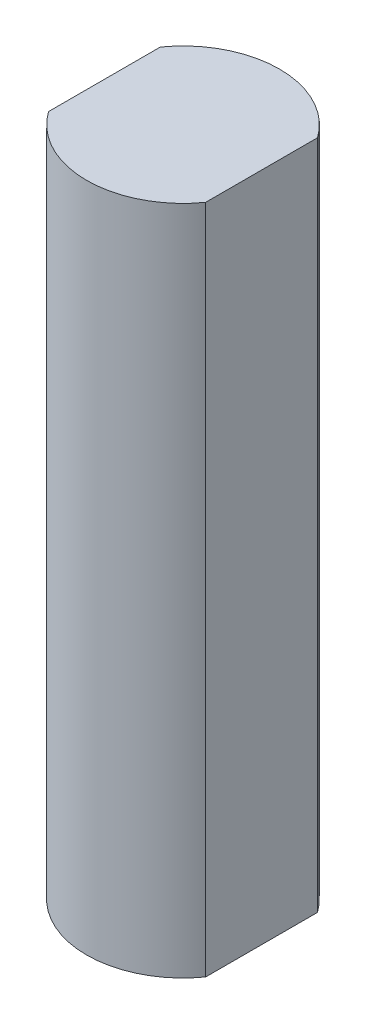
ISO-10303-21;
HEADER;
FILE_DESCRIPTION(('STEP AP214'),'2;1');
FILE_NAME('part.step','',(''),(''),'','','');
FILE_SCHEMA(('AUTOMOTIVE_DESIGN { 1 0 10303 214 1 1 1 1 }'));
ENDSEC;
DATA;
#1=APPLICATION_CONTEXT('core data for automotive mechanical design processes');
#2=APPLICATION_PROTOCOL_DEFINITION('international standard','automotive_design',2000,#1);
#3=PRODUCT_CONTEXT('',#1,'mechanical');
#4=PRODUCT('Part','Part','',(#3));
#5=PRODUCT_RELATED_PRODUCT_CATEGORY('part','',(#4));
#6=PRODUCT_DEFINITION_FORMATION('','',#4);
#7=PRODUCT_DEFINITION_CONTEXT('part definition',#1,'design');
#8=PRODUCT_DEFINITION('design','',#6,#7);
#9=PRODUCT_DEFINITION_SHAPE('','',#8);
#10=(LENGTH_UNIT() NAMED_UNIT(*) SI_UNIT(.MILLI.,.METRE.));
#11=(NAMED_UNIT(*) PLANE_ANGLE_UNIT() SI_UNIT($,.RADIAN.));
#12=(NAMED_UNIT(*) SI_UNIT($,.STERADIAN.) SOLID_ANGLE_UNIT());
#13=UNCERTAINTY_MEASURE_WITH_UNIT(LENGTH_MEASURE(1.E-05),#10,'distance_accuracy_value','');
#14=(GEOMETRIC_REPRESENTATION_CONTEXT(3) GLOBAL_UNCERTAINTY_ASSIGNED_CONTEXT((#13)) GLOBAL_UNIT_ASSIGNED_CONTEXT((#10,
#11,#12)) REPRESENTATION_CONTEXT('',''));
#15=CARTESIAN_POINT('',(0.,0.,0.));
#16=DIRECTION('',(0.,0.,1.));
#17=DIRECTION('',(1.,0.,0.));
#18=AXIS2_PLACEMENT_3D('',#15,#16,#17);
#19=CARTESIAN_POINT('',(0.,30.48,0.));
#20=DIRECTION('',(0.,-1.,0.));
#21=DIRECTION('',(0.,0.,-1.));
#22=AXIS2_PLACEMENT_3D('',#19,#20,#21);
#23=CYLINDRICAL_SURFACE('',#22,4.3815);
#24=DIRECTION('',(0.,1.,0.));
#25=VECTOR('',#24,1.);
#26=CARTESIAN_POINT('',(-3.57014597040513,-17.78,-2.54));
#27=LINE('',#26,#25);
#28=CARTESIAN_POINT('',(-3.57014597040513,0.,-2.54));
#29=VERTEX_POINT('',#28);
#30=CARTESIAN_POINT('',(-3.57014597040513,30.48,-2.54));
#31=VERTEX_POINT('',#30);
#32=EDGE_CURVE('E45',#29,#31,#27,.T.);
#33=ORIENTED_EDGE('',*,*,#32,.T.);
#34=CARTESIAN_POINT('',(0.,30.48,0.));
#35=DIRECTION('',(0.,1.,0.));
#36=DIRECTION('',(0.,0.,1.));
#37=AXIS2_PLACEMENT_3D('',#34,#35,#36);
#38=CIRCLE('',#37,4.3815);
#39=CARTESIAN_POINT('',(3.57014597040513,30.48,-2.54));
#40=VERTEX_POINT('',#39);
#41=EDGE_CURVE('E82',#40,#31,#38,.T.);
#42=ORIENTED_EDGE('',*,*,#41,.F.);
#43=DIRECTION('',(0.,1.,0.));
#44=VECTOR('',#43,1.);
#45=CARTESIAN_POINT('',(3.57014597040513,-17.78,-2.54));
#46=LINE('',#45,#44);
#47=CARTESIAN_POINT('',(3.57014597040513,0.,-2.54));
#48=VERTEX_POINT('',#47);
#49=EDGE_CURVE('E93',#48,#40,#46,.T.);
#50=ORIENTED_EDGE('',*,*,#49,.F.);
#51=CARTESIAN_POINT('',(0.,0.,0.));
#52=DIRECTION('',(0.,1.,0.));
#53=DIRECTION('',(0.,0.,1.));
#54=AXIS2_PLACEMENT_3D('',#51,#52,#53);
#55=CIRCLE('',#54,4.3815);
#56=EDGE_CURVE('E84',#48,#29,#55,.T.);
#57=ORIENTED_EDGE('',*,*,#56,.T.);
#58=EDGE_LOOP('',(#33,#42,#50,#57));
#59=FACE_BOUND('',#58,.T.);
#60=ADVANCED_FACE('F32',(#59),#23,.T.);
#61=DIRECTION('',(0.,1.,0.));
#62=VECTOR('',#61,1.);
#63=CARTESIAN_POINT('',(-3.57014597040513,-17.78,2.54));
#64=LINE('',#63,#62);
#65=CARTESIAN_POINT('',(-3.57014597040513,0.,2.54));
#66=VERTEX_POINT('',#65);
#67=CARTESIAN_POINT('',(-3.57014597040513,30.48,2.54));
#68=VERTEX_POINT('',#67);
#69=EDGE_CURVE('E72',#66,#68,#64,.T.);
#70=ORIENTED_EDGE('',*,*,#69,.F.);
#71=CARTESIAN_POINT('',(3.57014597040513,0.,2.54));
#72=VERTEX_POINT('',#71);
#73=EDGE_CURVE('E95',#66,#72,#55,.T.);
#74=ORIENTED_EDGE('',*,*,#73,.T.);
#75=DIRECTION('',(0.,1.,0.));
#76=VECTOR('',#75,1.);
#77=CARTESIAN_POINT('',(3.57014597040513,-17.78,2.54));
#78=LINE('',#77,#76);
#79=CARTESIAN_POINT('',(3.57014597040513,30.48,2.54));
#80=VERTEX_POINT('',#79);
#81=EDGE_CURVE('E53',#72,#80,#78,.T.);
#82=ORIENTED_EDGE('',*,*,#81,.T.);
#83=EDGE_CURVE('E89',#68,#80,#38,.T.);
#84=ORIENTED_EDGE('',*,*,#83,.F.);
#85=EDGE_LOOP('',(#70,#74,#82,#84));
#86=FACE_BOUND('',#85,.T.);
#87=ADVANCED_FACE('F104',(#86),#23,.T.);
#88=CARTESIAN_POINT('',(0.,30.48,0.));
#89=DIRECTION('',(0.,1.,0.));
#90=DIRECTION('',(0.,0.,1.));
#91=AXIS2_PLACEMENT_3D('',#88,#89,#90);
#92=PLANE('',#91);
#93=ORIENTED_EDGE('',*,*,#41,.T.);
#94=DIRECTION('',(0.,0.,1.));
#95=VECTOR('',#94,1.);
#96=CARTESIAN_POINT('',(-3.57014597040513,30.48,0.));
#97=LINE('',#96,#95);
#98=EDGE_CURVE('E69',#31,#68,#97,.T.);
#99=ORIENTED_EDGE('',*,*,#98,.T.);
#100=ORIENTED_EDGE('',*,*,#83,.T.);
#101=DIRECTION('',(0.,0.,1.));
#102=VECTOR('',#101,1.);
#103=CARTESIAN_POINT('',(3.57014597040513,30.48,0.));
#104=LINE('',#103,#102);
#105=EDGE_CURVE('E88',#40,#80,#104,.T.);
#106=ORIENTED_EDGE('',*,*,#105,.F.);
#107=EDGE_LOOP('',(#93,#99,#100,#106));
#108=FACE_BOUND('',#107,.T.);
#109=ADVANCED_FACE('F87',(#108),#92,.T.);
#110=CARTESIAN_POINT('',(0.,0.,0.));
#111=DIRECTION('',(0.,1.,0.));
#112=DIRECTION('',(0.,0.,1.));
#113=AXIS2_PLACEMENT_3D('',#110,#111,#112);
#114=PLANE('',#113);
#115=DIRECTION('',(0.,0.,1.));
#116=VECTOR('',#115,1.);
#117=CARTESIAN_POINT('',(-3.57014597040513,0.,0.));
#118=LINE('',#117,#116);
#119=EDGE_CURVE('E11',#29,#66,#118,.T.);
#120=ORIENTED_EDGE('',*,*,#119,.F.);
#121=ORIENTED_EDGE('',*,*,#56,.F.);
#122=DIRECTION('',(0.,0.,1.));
#123=VECTOR('',#122,1.);
#124=CARTESIAN_POINT('',(3.57014597040513,0.,0.));
#125=LINE('',#124,#123);
#126=EDGE_CURVE('E39',#48,#72,#125,.T.);
#127=ORIENTED_EDGE('',*,*,#126,.T.);
#128=ORIENTED_EDGE('',*,*,#73,.F.);
#129=EDGE_LOOP('',(#120,#121,#127,#128));
#130=FACE_BOUND('',#129,.T.);
#131=ADVANCED_FACE('F103',(#130),#114,.F.);
#132=CARTESIAN_POINT('',(3.57014597040513,-17.78,0.));
#133=DIRECTION('',(-1.,0.,0.));
#134=DIRECTION('',(0.,0.,1.));
#135=AXIS2_PLACEMENT_3D('',#132,#133,#134);
#136=PLANE('',#135);
#137=ORIENTED_EDGE('',*,*,#49,.T.);
#138=ORIENTED_EDGE('',*,*,#105,.T.);
#139=ORIENTED_EDGE('',*,*,#81,.F.);
#140=ORIENTED_EDGE('',*,*,#126,.F.);
#141=EDGE_LOOP('',(#137,#138,#139,#140));
#142=FACE_BOUND('',#141,.T.);
#143=ADVANCED_FACE('F101',(#142),#136,.F.);
#144=CARTESIAN_POINT('',(-3.57014597040513,-17.78,0.));
#145=DIRECTION('',(-1.,0.,0.));
#146=DIRECTION('',(0.,0.,1.));
#147=AXIS2_PLACEMENT_3D('',#144,#145,#146);
#148=PLANE('',#147);
#149=ORIENTED_EDGE('',*,*,#119,.T.);
#150=ORIENTED_EDGE('',*,*,#69,.T.);
#151=ORIENTED_EDGE('',*,*,#98,.F.);
#152=ORIENTED_EDGE('',*,*,#32,.F.);
#153=EDGE_LOOP('',(#149,#150,#151,#152));
#154=FACE_BOUND('',#153,.T.);
#155=ADVANCED_FACE('F70',(#154),#148,.T.);
#156=CLOSED_SHELL('',(#60,#87,#109,#131,#143,#155));
#157=MANIFOLD_SOLID_BREP('B2',#156);
#158=ADVANCED_BREP_SHAPE_REPRESENTATION('',(#18,#157),#14);
#159=SHAPE_DEFINITION_REPRESENTATION(#9,#158);
ENDSEC;
END-ISO-10303-21;
